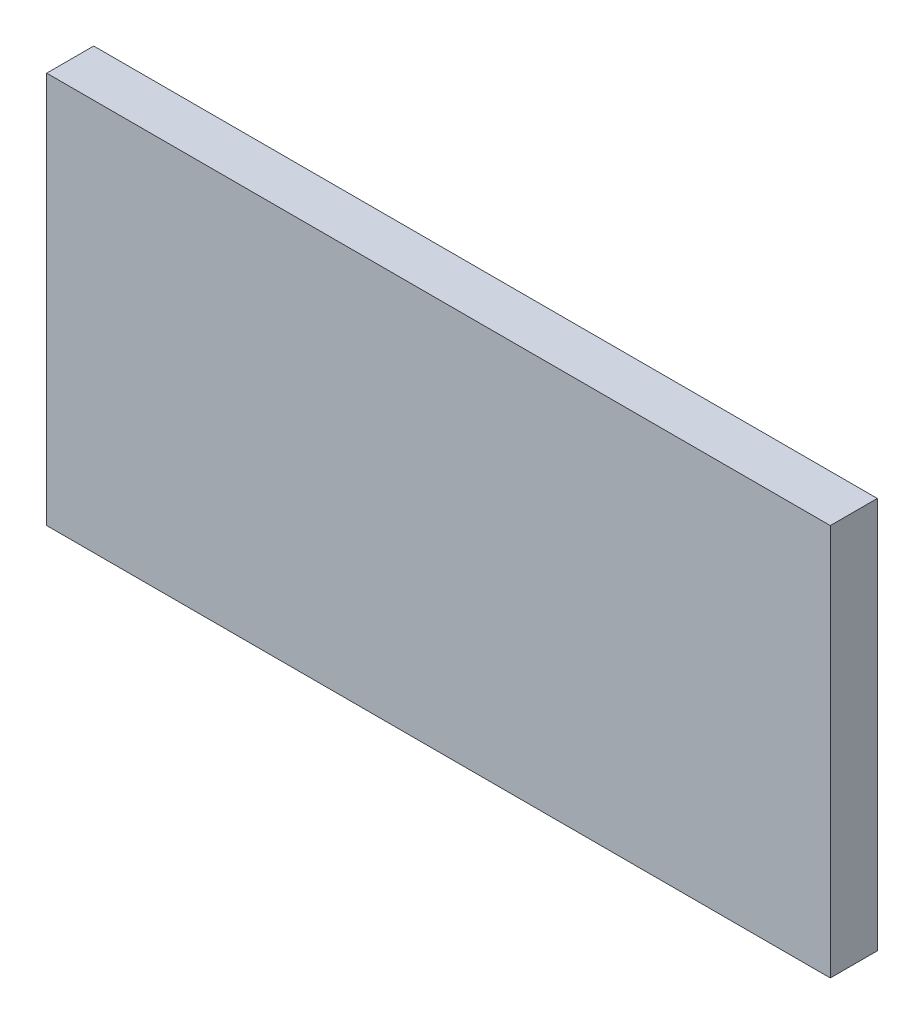
ISO-10303-21;
HEADER;
FILE_DESCRIPTION(('STEP AP214'),'2;1');
FILE_NAME('part.step','',(''),(''),'','','');
FILE_SCHEMA(('AUTOMOTIVE_DESIGN { 1 0 10303 214 1 1 1 1 }'));
ENDSEC;
DATA;
#1=APPLICATION_CONTEXT('core data for automotive mechanical design processes');
#2=APPLICATION_PROTOCOL_DEFINITION('international standard','automotive_design',2000,#1);
#3=PRODUCT_CONTEXT('',#1,'mechanical');
#4=PRODUCT('Part','Part','',(#3));
#5=PRODUCT_RELATED_PRODUCT_CATEGORY('part','',(#4));
#6=PRODUCT_DEFINITION_FORMATION('','',#4);
#7=PRODUCT_DEFINITION_CONTEXT('part definition',#1,'design');
#8=PRODUCT_DEFINITION('design','',#6,#7);
#9=PRODUCT_DEFINITION_SHAPE('','',#8);
#10=(LENGTH_UNIT() NAMED_UNIT(*) SI_UNIT(.MILLI.,.METRE.));
#11=(NAMED_UNIT(*) PLANE_ANGLE_UNIT() SI_UNIT($,.RADIAN.));
#12=(NAMED_UNIT(*) SI_UNIT($,.STERADIAN.) SOLID_ANGLE_UNIT());
#13=UNCERTAINTY_MEASURE_WITH_UNIT(LENGTH_MEASURE(1.E-05),#10,'distance_accuracy_value','');
#14=(GEOMETRIC_REPRESENTATION_CONTEXT(3) GLOBAL_UNCERTAINTY_ASSIGNED_CONTEXT((#13)) GLOBAL_UNIT_ASSIGNED_CONTEXT((#10,
#11,#12)) REPRESENTATION_CONTEXT('',''));
#15=CARTESIAN_POINT('',(0.,0.,0.));
#16=DIRECTION('',(0.,0.,1.));
#17=DIRECTION('',(1.,0.,0.));
#18=AXIS2_PLACEMENT_3D('',#15,#16,#17);
#19=CARTESIAN_POINT('',(-4.32489451476794,48.2172995780591,6.));
#20=DIRECTION('',(1.,0.,0.));
#21=DIRECTION('',(0.,1.,0.));
#22=AXIS2_PLACEMENT_3D('',#19,#20,#21);
#23=PLANE('',#22);
#24=DIRECTION('',(0.,-1.,0.));
#25=VECTOR('',#24,1.);
#26=CARTESIAN_POINT('',(-4.32489451476794,48.2172995780591,0.));
#27=LINE('',#26,#25);
#28=CARTESIAN_POINT('',(-4.32489451476794,48.2172995780591,0.));
#29=VERTEX_POINT('',#28);
#30=CARTESIAN_POINT('',(-4.32489451476793,-1.78270042194093,0.));
#31=VERTEX_POINT('',#30);
#32=EDGE_CURVE('E107',#29,#31,#27,.T.);
#33=ORIENTED_EDGE('',*,*,#32,.T.);
#34=DIRECTION('',(0.,0.,-1.));
#35=VECTOR('',#34,1.);
#36=CARTESIAN_POINT('',(-4.32489451476793,-1.78270042194093,6.));
#37=LINE('',#36,#35);
#38=CARTESIAN_POINT('',(-4.32489451476793,-1.78270042194093,6.));
#39=VERTEX_POINT('',#38);
#40=EDGE_CURVE('E11',#39,#31,#37,.T.);
#41=ORIENTED_EDGE('',*,*,#40,.F.);
#42=DIRECTION('',(0.,-1.,0.));
#43=VECTOR('',#42,1.);
#44=CARTESIAN_POINT('',(-4.32489451476794,48.2172995780591,6.));
#45=LINE('',#44,#43);
#46=CARTESIAN_POINT('',(-4.32489451476794,48.2172995780591,6.));
#47=VERTEX_POINT('',#46);
#48=EDGE_CURVE('E91',#47,#39,#45,.T.);
#49=ORIENTED_EDGE('',*,*,#48,.F.);
#50=DIRECTION('',(0.,0.,-1.));
#51=VECTOR('',#50,1.);
#52=CARTESIAN_POINT('',(-4.32489451476794,48.2172995780591,6.));
#53=LINE('',#52,#51);
#54=EDGE_CURVE('E103',#47,#29,#53,.T.);
#55=ORIENTED_EDGE('',*,*,#54,.T.);
#56=EDGE_LOOP('',(#33,#41,#49,#55));
#57=FACE_BOUND('',#56,.T.);
#58=ADVANCED_FACE('F39',(#57),#23,.F.);
#59=CARTESIAN_POINT('',(-4.32489451476793,-1.78270042194093,6.));
#60=DIRECTION('',(0.,1.,0.));
#61=DIRECTION('',(-1.,0.,0.));
#62=AXIS2_PLACEMENT_3D('',#59,#60,#61);
#63=PLANE('',#62);
#64=DIRECTION('',(1.,0.,0.));
#65=VECTOR('',#64,1.);
#66=CARTESIAN_POINT('',(-4.32489451476793,-1.78270042194093,0.));
#67=LINE('',#66,#65);
#68=CARTESIAN_POINT('',(95.6751054852321,-1.78270042194093,0.));
#69=VERTEX_POINT('',#68);
#70=EDGE_CURVE('E96',#31,#69,#67,.T.);
#71=ORIENTED_EDGE('',*,*,#70,.T.);
#72=DIRECTION('',(0.,0.,-1.));
#73=VECTOR('',#72,1.);
#74=CARTESIAN_POINT('',(95.6751054852321,-1.78270042194093,6.));
#75=LINE('',#74,#73);
#76=CARTESIAN_POINT('',(95.6751054852321,-1.78270042194093,6.));
#77=VERTEX_POINT('',#76);
#78=EDGE_CURVE('E48',#77,#69,#75,.T.);
#79=ORIENTED_EDGE('',*,*,#78,.F.);
#80=DIRECTION('',(1.,0.,0.));
#81=VECTOR('',#80,1.);
#82=CARTESIAN_POINT('',(-4.32489451476793,-1.78270042194093,6.));
#83=LINE('',#82,#81);
#84=EDGE_CURVE('E86',#39,#77,#83,.T.);
#85=ORIENTED_EDGE('',*,*,#84,.F.);
#86=ORIENTED_EDGE('',*,*,#40,.T.);
#87=EDGE_LOOP('',(#71,#79,#85,#86));
#88=FACE_BOUND('',#87,.T.);
#89=ADVANCED_FACE('F95',(#88),#63,.F.);
#90=CARTESIAN_POINT('',(95.6751054852321,48.2172995780591,6.));
#91=DIRECTION('',(-1.,0.,0.));
#92=DIRECTION('',(0.,-1.,0.));
#93=AXIS2_PLACEMENT_3D('',#90,#91,#92);
#94=PLANE('',#93);
#95=DIRECTION('',(0.,1.,0.));
#96=VECTOR('',#95,1.);
#97=CARTESIAN_POINT('',(95.6751054852321,48.2172995780591,0.));
#98=LINE('',#97,#96);
#99=CARTESIAN_POINT('',(95.6751054852321,48.2172995780591,0.));
#100=VERTEX_POINT('',#99);
#101=EDGE_CURVE('E73',#69,#100,#98,.T.);
#102=ORIENTED_EDGE('',*,*,#101,.T.);
#103=DIRECTION('',(0.,0.,-1.));
#104=VECTOR('',#103,1.);
#105=CARTESIAN_POINT('',(95.6751054852321,48.2172995780591,6.));
#106=LINE('',#105,#104);
#107=CARTESIAN_POINT('',(95.6751054852321,48.2172995780591,6.));
#108=VERTEX_POINT('',#107);
#109=EDGE_CURVE('E98',#108,#100,#106,.T.);
#110=ORIENTED_EDGE('',*,*,#109,.F.);
#111=DIRECTION('',(0.,1.,0.));
#112=VECTOR('',#111,1.);
#113=CARTESIAN_POINT('',(95.6751054852321,48.2172995780591,6.));
#114=LINE('',#113,#112);
#115=EDGE_CURVE('E89',#77,#108,#114,.T.);
#116=ORIENTED_EDGE('',*,*,#115,.F.);
#117=ORIENTED_EDGE('',*,*,#78,.T.);
#118=EDGE_LOOP('',(#102,#110,#116,#117));
#119=FACE_BOUND('',#118,.T.);
#120=ADVANCED_FACE('F99',(#119),#94,.F.);
#121=CARTESIAN_POINT('',(-4.32489451476794,48.2172995780591,6.));
#122=DIRECTION('',(0.,-1.,0.));
#123=DIRECTION('',(0.,0.,-1.));
#124=AXIS2_PLACEMENT_3D('',#121,#122,#123);
#125=PLANE('',#124);
#126=DIRECTION('',(-1.,0.,0.));
#127=VECTOR('',#126,1.);
#128=CARTESIAN_POINT('',(-4.32489451476794,48.2172995780591,0.));
#129=LINE('',#128,#127);
#130=EDGE_CURVE('E79',#100,#29,#129,.T.);
#131=ORIENTED_EDGE('',*,*,#130,.T.);
#132=ORIENTED_EDGE('',*,*,#54,.F.);
#133=DIRECTION('',(-1.,0.,0.));
#134=VECTOR('',#133,1.);
#135=CARTESIAN_POINT('',(-4.32489451476794,48.2172995780591,6.));
#136=LINE('',#135,#134);
#137=EDGE_CURVE('E56',#108,#47,#136,.T.);
#138=ORIENTED_EDGE('',*,*,#137,.F.);
#139=ORIENTED_EDGE('',*,*,#109,.T.);
#140=EDGE_LOOP('',(#131,#132,#138,#139));
#141=FACE_BOUND('',#140,.T.);
#142=ADVANCED_FACE('F120',(#141),#125,.F.);
#143=CARTESIAN_POINT('',(0.,0.,6.));
#144=DIRECTION('',(0.,0.,1.));
#145=DIRECTION('',(1.,0.,0.));
#146=AXIS2_PLACEMENT_3D('',#143,#144,#145);
#147=PLANE('',#146);
#148=ORIENTED_EDGE('',*,*,#48,.T.);
#149=ORIENTED_EDGE('',*,*,#84,.T.);
#150=ORIENTED_EDGE('',*,*,#115,.T.);
#151=ORIENTED_EDGE('',*,*,#137,.T.);
#152=EDGE_LOOP('',(#148,#149,#150,#151));
#153=FACE_BOUND('',#152,.T.);
#154=ADVANCED_FACE('F87',(#153),#147,.T.);
#155=CARTESIAN_POINT('',(0.,0.,0.));
#156=DIRECTION('',(0.,0.,1.));
#157=DIRECTION('',(1.,0.,0.));
#158=AXIS2_PLACEMENT_3D('',#155,#156,#157);
#159=PLANE('',#158);
#160=ORIENTED_EDGE('',*,*,#32,.F.);
#161=ORIENTED_EDGE('',*,*,#130,.F.);
#162=ORIENTED_EDGE('',*,*,#101,.F.);
#163=ORIENTED_EDGE('',*,*,#70,.F.);
#164=EDGE_LOOP('',(#160,#161,#162,#163));
#165=FACE_BOUND('',#164,.T.);
#166=ADVANCED_FACE('F123',(#165),#159,.F.);
#167=CLOSED_SHELL('',(#58,#89,#120,#142,#154,#166));
#168=MANIFOLD_SOLID_BREP('B2',#167);
#169=ADVANCED_BREP_SHAPE_REPRESENTATION('',(#18,#168),#14);
#170=SHAPE_DEFINITION_REPRESENTATION(#9,#169);
ENDSEC;
END-ISO-10303-21;
